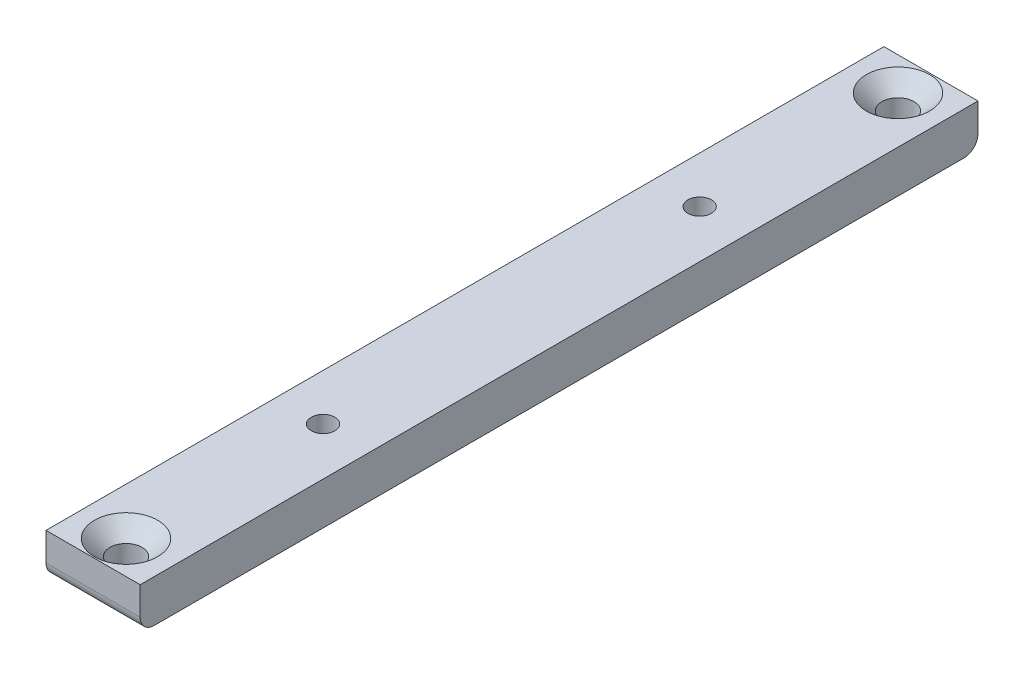
ISO-10303-21;
HEADER;
FILE_DESCRIPTION(('STEP AP214'),'2;1');
FILE_NAME('part.step','',(''),(''),'','','');
FILE_SCHEMA(('AUTOMOTIVE_DESIGN { 1 0 10303 214 1 1 1 1 }'));
ENDSEC;
DATA;
#1=APPLICATION_CONTEXT('core data for automotive mechanical design processes');
#2=APPLICATION_PROTOCOL_DEFINITION('international standard','automotive_design',2000,#1);
#3=PRODUCT_CONTEXT('',#1,'mechanical');
#4=PRODUCT('Part','Part','',(#3));
#5=PRODUCT_RELATED_PRODUCT_CATEGORY('part','',(#4));
#6=PRODUCT_DEFINITION_FORMATION('','',#4);
#7=PRODUCT_DEFINITION_CONTEXT('part definition',#1,'design');
#8=PRODUCT_DEFINITION('design','',#6,#7);
#9=PRODUCT_DEFINITION_SHAPE('','',#8);
#10=(LENGTH_UNIT() NAMED_UNIT(*) SI_UNIT(.MILLI.,.METRE.));
#11=(NAMED_UNIT(*) PLANE_ANGLE_UNIT() SI_UNIT($,.RADIAN.));
#12=(NAMED_UNIT(*) SI_UNIT($,.STERADIAN.) SOLID_ANGLE_UNIT());
#13=UNCERTAINTY_MEASURE_WITH_UNIT(LENGTH_MEASURE(1.E-05),#10,'distance_accuracy_value','');
#14=(GEOMETRIC_REPRESENTATION_CONTEXT(3) GLOBAL_UNCERTAINTY_ASSIGNED_CONTEXT((#13)) GLOBAL_UNIT_ASSIGNED_CONTEXT((#10,
#11,#12)) REPRESENTATION_CONTEXT('',''));
#15=CARTESIAN_POINT('',(0.,0.,0.));
#16=DIRECTION('',(0.,0.,1.));
#17=DIRECTION('',(1.,0.,0.));
#18=AXIS2_PLACEMENT_3D('',#15,#16,#17);
#19=CARTESIAN_POINT('',(10.,-4.50000000000001,0.));
#20=DIRECTION('',(0.,0.,-1.));
#21=DIRECTION('',(-1.,0.,0.));
#22=AXIS2_PLACEMENT_3D('',#19,#20,#21);
#23=PLANE('',#22);
#24=DIRECTION('',(0.,-1.,0.));
#25=VECTOR('',#24,1.);
#26=CARTESIAN_POINT('',(0.,-4.50000000000001,0.));
#27=LINE('',#26,#25);
#28=CARTESIAN_POINT('',(0.,0.,0.));
#29=VERTEX_POINT('',#28);
#30=CARTESIAN_POINT('',(0.,-3.00000000000001,0.));
#31=VERTEX_POINT('',#30);
#32=EDGE_CURVE('E119',#29,#31,#27,.T.);
#33=ORIENTED_EDGE('',*,*,#32,.T.);
#34=DIRECTION('',(-1.,0.,0.));
#35=VECTOR('',#34,1.);
#36=CARTESIAN_POINT('',(10.,-3.00000000000001,0.));
#37=LINE('',#36,#35);
#38=CARTESIAN_POINT('',(10.,-3.00000000000001,0.));
#39=VERTEX_POINT('',#38);
#40=EDGE_CURVE('E11',#31,#39,#37,.F.);
#41=ORIENTED_EDGE('',*,*,#40,.T.);
#42=DIRECTION('',(0.,-1.,0.));
#43=VECTOR('',#42,1.);
#44=CARTESIAN_POINT('',(10.,-4.50000000000001,0.));
#45=LINE('',#44,#43);
#46=CARTESIAN_POINT('',(10.,0.,0.));
#47=VERTEX_POINT('',#46);
#48=EDGE_CURVE('E126',#47,#39,#45,.T.);
#49=ORIENTED_EDGE('',*,*,#48,.F.);
#50=DIRECTION('',(-1.,0.,0.));
#51=VECTOR('',#50,1.);
#52=CARTESIAN_POINT('',(10.,0.,0.));
#53=LINE('',#52,#51);
#54=EDGE_CURVE('E111',#47,#29,#53,.T.);
#55=ORIENTED_EDGE('',*,*,#54,.T.);
#56=EDGE_LOOP('',(#33,#41,#49,#55));
#57=FACE_BOUND('',#56,.T.);
#58=ADVANCED_FACE('F37',(#57),#23,.F.);
#59=CARTESIAN_POINT('',(10.,-4.5,-89.));
#60=DIRECTION('',(0.,1.,0.));
#61=DIRECTION('',(0.,0.,1.));
#62=AXIS2_PLACEMENT_3D('',#59,#60,#61);
#63=PLANE('',#62);
#64=CARTESIAN_POINT('',(4.93373650886042,-4.50000000000001,-24.5));
#65=DIRECTION('',(0.,1.,0.));
#66=DIRECTION('',(0.,0.,1.));
#67=AXIS2_PLACEMENT_3D('',#64,#65,#66);
#68=CIRCLE('',#67,1.24999999999999);
#69=CARTESIAN_POINT('',(4.93373650886042,-4.50000000000001,-23.25));
#70=VERTEX_POINT('',#69);
#71=EDGE_CURVE('E171',#70,#70,#68,.T.);
#72=ORIENTED_EDGE('',*,*,#71,.T.);
#73=EDGE_LOOP('',(#72));
#74=FACE_BOUND('',#73,.T.);
#75=CARTESIAN_POINT('',(4.93373650886042,-4.5,-64.5));
#76=DIRECTION('',(0.,1.,0.));
#77=DIRECTION('',(0.,0.,1.));
#78=AXIS2_PLACEMENT_3D('',#75,#76,#77);
#79=CIRCLE('',#78,1.24999999999999);
#80=CARTESIAN_POINT('',(4.93373650886042,-4.5,-63.25));
#81=VERTEX_POINT('',#80);
#82=EDGE_CURVE('E165',#81,#81,#79,.T.);
#83=ORIENTED_EDGE('',*,*,#82,.T.);
#84=EDGE_LOOP('',(#83));
#85=FACE_BOUND('',#84,.T.);
#86=CARTESIAN_POINT('',(5.,-4.5,-3.5));
#87=DIRECTION('',(0.,1.,0.));
#88=DIRECTION('',(0.,0.,1.));
#89=AXIS2_PLACEMENT_3D('',#86,#87,#88);
#90=CIRCLE('',#89,1.69999999999999);
#91=CARTESIAN_POINT('',(5.,-4.5,-1.80000000000001));
#92=VERTEX_POINT('',#91);
#93=EDGE_CURVE('E156',#92,#92,#90,.T.);
#94=ORIENTED_EDGE('',*,*,#93,.T.);
#95=EDGE_LOOP('',(#94));
#96=FACE_BOUND('',#95,.T.);
#97=CARTESIAN_POINT('',(5.,-4.5,-85.5));
#98=DIRECTION('',(0.,1.,0.));
#99=DIRECTION('',(0.,0.,1.));
#100=AXIS2_PLACEMENT_3D('',#97,#98,#99);
#101=CIRCLE('',#100,1.69999999999999);
#102=CARTESIAN_POINT('',(5.,-4.5,-83.8));
#103=VERTEX_POINT('',#102);
#104=EDGE_CURVE('E122',#103,#103,#101,.T.);
#105=ORIENTED_EDGE('',*,*,#104,.T.);
#106=EDGE_LOOP('',(#105));
#107=FACE_BOUND('',#106,.T.);
#108=DIRECTION('',(0.,0.,-1.));
#109=VECTOR('',#108,1.);
#110=CARTESIAN_POINT('',(0.,-4.5,-89.));
#111=LINE('',#110,#109);
#112=CARTESIAN_POINT('',(0.,-4.50000000000001,-1.5));
#113=VERTEX_POINT('',#112);
#114=CARTESIAN_POINT('',(0.,-4.5,-87.5));
#115=VERTEX_POINT('',#114);
#116=EDGE_CURVE('E121',#113,#115,#111,.T.);
#117=ORIENTED_EDGE('',*,*,#116,.T.);
#118=DIRECTION('',(-1.,0.,0.));
#119=VECTOR('',#118,1.);
#120=CARTESIAN_POINT('',(10.,-4.5,-87.5));
#121=LINE('',#120,#119);
#122=CARTESIAN_POINT('',(10.,-4.5,-87.5));
#123=VERTEX_POINT('',#122);
#124=EDGE_CURVE('E58',#115,#123,#121,.F.);
#125=ORIENTED_EDGE('',*,*,#124,.T.);
#126=DIRECTION('',(0.,0.,-1.));
#127=VECTOR('',#126,1.);
#128=CARTESIAN_POINT('',(10.,-4.5,-89.));
#129=LINE('',#128,#127);
#130=CARTESIAN_POINT('',(10.,-4.50000000000001,-1.5));
#131=VERTEX_POINT('',#130);
#132=EDGE_CURVE('E101',#131,#123,#129,.T.);
#133=ORIENTED_EDGE('',*,*,#132,.F.);
#134=DIRECTION('',(-1.,0.,0.));
#135=VECTOR('',#134,1.);
#136=CARTESIAN_POINT('',(10.,-4.50000000000001,-1.5));
#137=LINE('',#136,#135);
#138=EDGE_CURVE('E133',#131,#113,#137,.T.);
#139=ORIENTED_EDGE('',*,*,#138,.T.);
#140=EDGE_LOOP('',(#117,#125,#133,#139));
#141=FACE_BOUND('',#140,.T.);
#142=ADVANCED_FACE('F141',(#74,#85,#96,#107,#141),#63,.F.);
#143=CARTESIAN_POINT('',(10.,0.,-89.));
#144=DIRECTION('',(0.,0.,1.));
#145=DIRECTION('',(1.,0.,0.));
#146=AXIS2_PLACEMENT_3D('',#143,#144,#145);
#147=PLANE('',#146);
#148=DIRECTION('',(0.,1.,0.));
#149=VECTOR('',#148,1.);
#150=CARTESIAN_POINT('',(10.,0.,-89.));
#151=LINE('',#150,#149);
#152=CARTESIAN_POINT('',(10.,-3.,-89.));
#153=VERTEX_POINT('',#152);
#154=CARTESIAN_POINT('',(10.,0.,-89.));
#155=VERTEX_POINT('',#154);
#156=EDGE_CURVE('E91',#153,#155,#151,.T.);
#157=ORIENTED_EDGE('',*,*,#156,.F.);
#158=DIRECTION('',(-1.,0.,0.));
#159=VECTOR('',#158,1.);
#160=CARTESIAN_POINT('',(10.,-3.,-89.));
#161=LINE('',#160,#159);
#162=CARTESIAN_POINT('',(0.,-3.,-89.));
#163=VERTEX_POINT('',#162);
#164=EDGE_CURVE('E110',#153,#163,#161,.T.);
#165=ORIENTED_EDGE('',*,*,#164,.T.);
#166=DIRECTION('',(0.,1.,0.));
#167=VECTOR('',#166,1.);
#168=CARTESIAN_POINT('',(0.,0.,-89.));
#169=LINE('',#168,#167);
#170=CARTESIAN_POINT('',(0.,0.,-89.));
#171=VERTEX_POINT('',#170);
#172=EDGE_CURVE('E107',#163,#171,#169,.T.);
#173=ORIENTED_EDGE('',*,*,#172,.T.);
#174=DIRECTION('',(-1.,0.,0.));
#175=VECTOR('',#174,1.);
#176=CARTESIAN_POINT('',(10.,0.,-89.));
#177=LINE('',#176,#175);
#178=EDGE_CURVE('E104',#155,#171,#177,.T.);
#179=ORIENTED_EDGE('',*,*,#178,.F.);
#180=EDGE_LOOP('',(#157,#165,#173,#179));
#181=FACE_BOUND('',#180,.T.);
#182=ADVANCED_FACE('F105',(#181),#147,.F.);
#183=CARTESIAN_POINT('',(10.,0.,0.));
#184=DIRECTION('',(0.,-1.,0.));
#185=DIRECTION('',(0.,0.,-1.));
#186=AXIS2_PLACEMENT_3D('',#183,#184,#185);
#187=PLANE('',#186);
#188=CARTESIAN_POINT('',(4.93373650886042,0.,-24.5));
#189=DIRECTION('',(0.,1.,0.));
#190=DIRECTION('',(0.,0.,1.));
#191=AXIS2_PLACEMENT_3D('',#188,#189,#190);
#192=CIRCLE('',#191,1.24999999999999);
#193=CARTESIAN_POINT('',(4.93373650886042,0.,-23.25));
#194=VERTEX_POINT('',#193);
#195=EDGE_CURVE('E174',#194,#194,#192,.T.);
#196=ORIENTED_EDGE('',*,*,#195,.F.);
#197=EDGE_LOOP('',(#196));
#198=FACE_BOUND('',#197,.T.);
#199=CARTESIAN_POINT('',(4.93373650886042,0.,-64.5));
#200=DIRECTION('',(0.,1.,0.));
#201=DIRECTION('',(0.,0.,1.));
#202=AXIS2_PLACEMENT_3D('',#199,#200,#201);
#203=CIRCLE('',#202,1.24999999999999);
#204=CARTESIAN_POINT('',(4.93373650886042,0.,-63.25));
#205=VERTEX_POINT('',#204);
#206=EDGE_CURVE('E168',#205,#205,#203,.T.);
#207=ORIENTED_EDGE('',*,*,#206,.F.);
#208=EDGE_LOOP('',(#207));
#209=FACE_BOUND('',#208,.T.);
#210=CARTESIAN_POINT('',(5.,0.,-3.5));
#211=DIRECTION('',(0.,1.,0.));
#212=DIRECTION('',(0.,0.,1.));
#213=AXIS2_PLACEMENT_3D('',#210,#211,#212);
#214=CIRCLE('',#213,3.36);
#215=CARTESIAN_POINT('',(5.,0.,-0.139999999999999));
#216=VERTEX_POINT('',#215);
#217=EDGE_CURVE('E162',#216,#216,#214,.T.);
#218=ORIENTED_EDGE('',*,*,#217,.F.);
#219=EDGE_LOOP('',(#218));
#220=FACE_BOUND('',#219,.T.);
#221=CARTESIAN_POINT('',(5.,0.,-85.5));
#222=DIRECTION('',(0.,1.,0.));
#223=DIRECTION('',(0.,0.,1.));
#224=AXIS2_PLACEMENT_3D('',#221,#222,#223);
#225=CIRCLE('',#224,3.36);
#226=CARTESIAN_POINT('',(5.,0.,-82.14));
#227=VERTEX_POINT('',#226);
#228=EDGE_CURVE('E153',#227,#227,#225,.T.);
#229=ORIENTED_EDGE('',*,*,#228,.F.);
#230=EDGE_LOOP('',(#229));
#231=FACE_BOUND('',#230,.T.);
#232=DIRECTION('',(0.,0.,1.));
#233=VECTOR('',#232,1.);
#234=CARTESIAN_POINT('',(0.,0.,0.));
#235=LINE('',#234,#233);
#236=EDGE_CURVE('E125',#171,#29,#235,.T.);
#237=ORIENTED_EDGE('',*,*,#236,.T.);
#238=ORIENTED_EDGE('',*,*,#54,.F.);
#239=DIRECTION('',(0.,0.,1.));
#240=VECTOR('',#239,1.);
#241=CARTESIAN_POINT('',(10.,0.,0.));
#242=LINE('',#241,#240);
#243=EDGE_CURVE('E95',#155,#47,#242,.T.);
#244=ORIENTED_EDGE('',*,*,#243,.F.);
#245=ORIENTED_EDGE('',*,*,#178,.T.);
#246=EDGE_LOOP('',(#237,#238,#244,#245));
#247=FACE_BOUND('',#246,.T.);
#248=ADVANCED_FACE('F113',(#198,#209,#220,#231,#247),#187,.F.);
#249=CARTESIAN_POINT('',(10.,0.,0.));
#250=DIRECTION('',(-1.,0.,0.));
#251=DIRECTION('',(0.,0.,1.));
#252=AXIS2_PLACEMENT_3D('',#249,#250,#251);
#253=PLANE('',#252);
#254=ORIENTED_EDGE('',*,*,#132,.T.);
#255=CARTESIAN_POINT('',(10.,-3.,-87.5));
#256=DIRECTION('',(-1.,0.,0.));
#257=DIRECTION('',(0.,0.,1.));
#258=AXIS2_PLACEMENT_3D('',#255,#256,#257);
#259=CIRCLE('',#258,1.5);
#260=EDGE_CURVE('E45',#123,#153,#259,.F.);
#261=ORIENTED_EDGE('',*,*,#260,.T.);
#262=ORIENTED_EDGE('',*,*,#156,.T.);
#263=ORIENTED_EDGE('',*,*,#243,.T.);
#264=ORIENTED_EDGE('',*,*,#48,.T.);
#265=CARTESIAN_POINT('',(10.,-3.00000000000001,-1.5));
#266=DIRECTION('',(-1.,0.,0.));
#267=DIRECTION('',(0.,0.,1.));
#268=AXIS2_PLACEMENT_3D('',#265,#266,#267);
#269=CIRCLE('',#268,1.5);
#270=EDGE_CURVE('E137',#39,#131,#269,.F.);
#271=ORIENTED_EDGE('',*,*,#270,.T.);
#272=EDGE_LOOP('',(#254,#261,#262,#263,#264,#271));
#273=FACE_BOUND('',#272,.T.);
#274=ADVANCED_FACE('F93',(#273),#253,.F.);
#275=CARTESIAN_POINT('',(0.,0.,0.));
#276=DIRECTION('',(-1.,0.,0.));
#277=DIRECTION('',(0.,0.,1.));
#278=AXIS2_PLACEMENT_3D('',#275,#276,#277);
#279=PLANE('',#278);
#280=ORIENTED_EDGE('',*,*,#172,.F.);
#281=CARTESIAN_POINT('',(0.,-3.,-87.5));
#282=DIRECTION('',(-1.,0.,0.));
#283=DIRECTION('',(0.,0.,1.));
#284=AXIS2_PLACEMENT_3D('',#281,#282,#283);
#285=CIRCLE('',#284,1.5);
#286=EDGE_CURVE('E131',#163,#115,#285,.T.);
#287=ORIENTED_EDGE('',*,*,#286,.T.);
#288=ORIENTED_EDGE('',*,*,#116,.F.);
#289=CARTESIAN_POINT('',(0.,-3.00000000000001,-1.5));
#290=DIRECTION('',(-1.,0.,0.));
#291=DIRECTION('',(0.,0.,1.));
#292=AXIS2_PLACEMENT_3D('',#289,#290,#291);
#293=CIRCLE('',#292,1.5);
#294=EDGE_CURVE('E129',#113,#31,#293,.T.);
#295=ORIENTED_EDGE('',*,*,#294,.T.);
#296=ORIENTED_EDGE('',*,*,#32,.F.);
#297=ORIENTED_EDGE('',*,*,#236,.F.);
#298=EDGE_LOOP('',(#280,#287,#288,#295,#296,#297));
#299=FACE_BOUND('',#298,.T.);
#300=ADVANCED_FACE('F145',(#299),#279,.T.);
#301=CARTESIAN_POINT('',(10.,-3.,-87.5));
#302=DIRECTION('',(-1.,0.,0.));
#303=DIRECTION('',(0.,0.,1.));
#304=AXIS2_PLACEMENT_3D('',#301,#302,#303);
#305=CYLINDRICAL_SURFACE('',#304,1.5);
#306=ORIENTED_EDGE('',*,*,#260,.F.);
#307=ORIENTED_EDGE('',*,*,#124,.F.);
#308=ORIENTED_EDGE('',*,*,#286,.F.);
#309=ORIENTED_EDGE('',*,*,#164,.F.);
#310=EDGE_LOOP('',(#306,#307,#308,#309));
#311=FACE_BOUND('',#310,.T.);
#312=ADVANCED_FACE('F215',(#311),#305,.T.);
#313=CARTESIAN_POINT('',(10.,-3.00000000000001,-1.5));
#314=DIRECTION('',(-1.,0.,0.));
#315=DIRECTION('',(0.,0.,1.));
#316=AXIS2_PLACEMENT_3D('',#313,#314,#315);
#317=CYLINDRICAL_SURFACE('',#316,1.5);
#318=ORIENTED_EDGE('',*,*,#270,.F.);
#319=ORIENTED_EDGE('',*,*,#40,.F.);
#320=ORIENTED_EDGE('',*,*,#294,.F.);
#321=ORIENTED_EDGE('',*,*,#138,.F.);
#322=EDGE_LOOP('',(#318,#319,#320,#321));
#323=FACE_BOUND('',#322,.T.);
#324=ADVANCED_FACE('F39',(#323),#317,.T.);
#325=CARTESIAN_POINT('',(5.,0.,-85.5));
#326=DIRECTION('',(0.,1.,0.));
#327=DIRECTION('',(0.,0.,1.));
#328=AXIS2_PLACEMENT_3D('',#325,#326,#327);
#329=CYLINDRICAL_SURFACE('',#328,1.69999999999999);
#330=ORIENTED_EDGE('',*,*,#104,.F.);
#331=EDGE_LOOP('',(#330));
#332=FACE_BOUND('',#331,.T.);
#333=CARTESIAN_POINT('',(5.,-1.66000000000002,-85.5));
#334=DIRECTION('',(0.,1.,0.));
#335=DIRECTION('',(0.,0.,1.));
#336=AXIS2_PLACEMENT_3D('',#333,#334,#335);
#337=CIRCLE('',#336,1.69999999999999);
#338=CARTESIAN_POINT('',(5.,-1.66000000000002,-83.8));
#339=VERTEX_POINT('',#338);
#340=EDGE_CURVE('E150',#339,#339,#337,.T.);
#341=ORIENTED_EDGE('',*,*,#340,.T.);
#342=EDGE_LOOP('',(#341));
#343=FACE_BOUND('',#342,.T.);
#344=ADVANCED_FACE('F193',(#332,#343),#329,.F.);
#345=CARTESIAN_POINT('',(5.,0.,-85.5));
#346=DIRECTION('',(0.,1.,0.));
#347=DIRECTION('',(0.,0.,1.));
#348=AXIS2_PLACEMENT_3D('',#345,#346,#347);
#349=CONICAL_SURFACE('',#348,3.36,0.785398163397445);
#350=ORIENTED_EDGE('',*,*,#340,.F.);
#351=EDGE_LOOP('',(#350));
#352=FACE_BOUND('',#351,.T.);
#353=ORIENTED_EDGE('',*,*,#228,.T.);
#354=EDGE_LOOP('',(#353));
#355=FACE_BOUND('',#354,.T.);
#356=ADVANCED_FACE('F190',(#352,#355),#349,.F.);
#357=CARTESIAN_POINT('',(5.,0.,-3.5));
#358=DIRECTION('',(0.,1.,0.));
#359=DIRECTION('',(0.,0.,1.));
#360=AXIS2_PLACEMENT_3D('',#357,#358,#359);
#361=CYLINDRICAL_SURFACE('',#360,1.69999999999999);
#362=ORIENTED_EDGE('',*,*,#93,.F.);
#363=EDGE_LOOP('',(#362));
#364=FACE_BOUND('',#363,.T.);
#365=CARTESIAN_POINT('',(5.,-1.66000000000002,-3.5));
#366=DIRECTION('',(0.,1.,0.));
#367=DIRECTION('',(0.,0.,1.));
#368=AXIS2_PLACEMENT_3D('',#365,#366,#367);
#369=CIRCLE('',#368,1.69999999999999);
#370=CARTESIAN_POINT('',(5.,-1.66000000000002,-1.80000000000001));
#371=VERTEX_POINT('',#370);
#372=EDGE_CURVE('E159',#371,#371,#369,.T.);
#373=ORIENTED_EDGE('',*,*,#372,.T.);
#374=EDGE_LOOP('',(#373));
#375=FACE_BOUND('',#374,.T.);
#376=ADVANCED_FACE('F192',(#364,#375),#361,.F.);
#377=CARTESIAN_POINT('',(5.,0.,-3.5));
#378=DIRECTION('',(0.,1.,0.));
#379=DIRECTION('',(0.,0.,1.));
#380=AXIS2_PLACEMENT_3D('',#377,#378,#379);
#381=CONICAL_SURFACE('',#380,3.36,0.785398163397445);
#382=ORIENTED_EDGE('',*,*,#372,.F.);
#383=EDGE_LOOP('',(#382));
#384=FACE_BOUND('',#383,.T.);
#385=ORIENTED_EDGE('',*,*,#217,.T.);
#386=EDGE_LOOP('',(#385));
#387=FACE_BOUND('',#386,.T.);
#388=ADVANCED_FACE('F200',(#384,#387),#381,.F.);
#389=CARTESIAN_POINT('',(4.93373650886042,0.,-64.5));
#390=DIRECTION('',(0.,1.,0.));
#391=DIRECTION('',(0.,0.,1.));
#392=AXIS2_PLACEMENT_3D('',#389,#390,#391);
#393=CYLINDRICAL_SURFACE('',#392,1.24999999999999);
#394=ORIENTED_EDGE('',*,*,#206,.T.);
#395=EDGE_LOOP('',(#394));
#396=FACE_BOUND('',#395,.T.);
#397=ORIENTED_EDGE('',*,*,#82,.F.);
#398=EDGE_LOOP('',(#397));
#399=FACE_BOUND('',#398,.T.);
#400=ADVANCED_FACE('F281',(#396,#399),#393,.F.);
#401=CARTESIAN_POINT('',(4.93373650886042,0.,-24.5));
#402=DIRECTION('',(0.,1.,0.));
#403=DIRECTION('',(0.,0.,1.));
#404=AXIS2_PLACEMENT_3D('',#401,#402,#403);
#405=CYLINDRICAL_SURFACE('',#404,1.24999999999999);
#406=ORIENTED_EDGE('',*,*,#195,.T.);
#407=EDGE_LOOP('',(#406));
#408=FACE_BOUND('',#407,.T.);
#409=ORIENTED_EDGE('',*,*,#71,.F.);
#410=EDGE_LOOP('',(#409));
#411=FACE_BOUND('',#410,.T.);
#412=ADVANCED_FACE('F178',(#408,#411),#405,.F.);
#413=CLOSED_SHELL('',(#58,#142,#182,#248,#274,#300,#312,#324,#344,#356,#376,#388,#400,#412));
#414=MANIFOLD_SOLID_BREP('B2',#413);
#415=ADVANCED_BREP_SHAPE_REPRESENTATION('',(#18,#414),#14);
#416=SHAPE_DEFINITION_REPRESENTATION(#9,#415);
ENDSEC;
END-ISO-10303-21;
